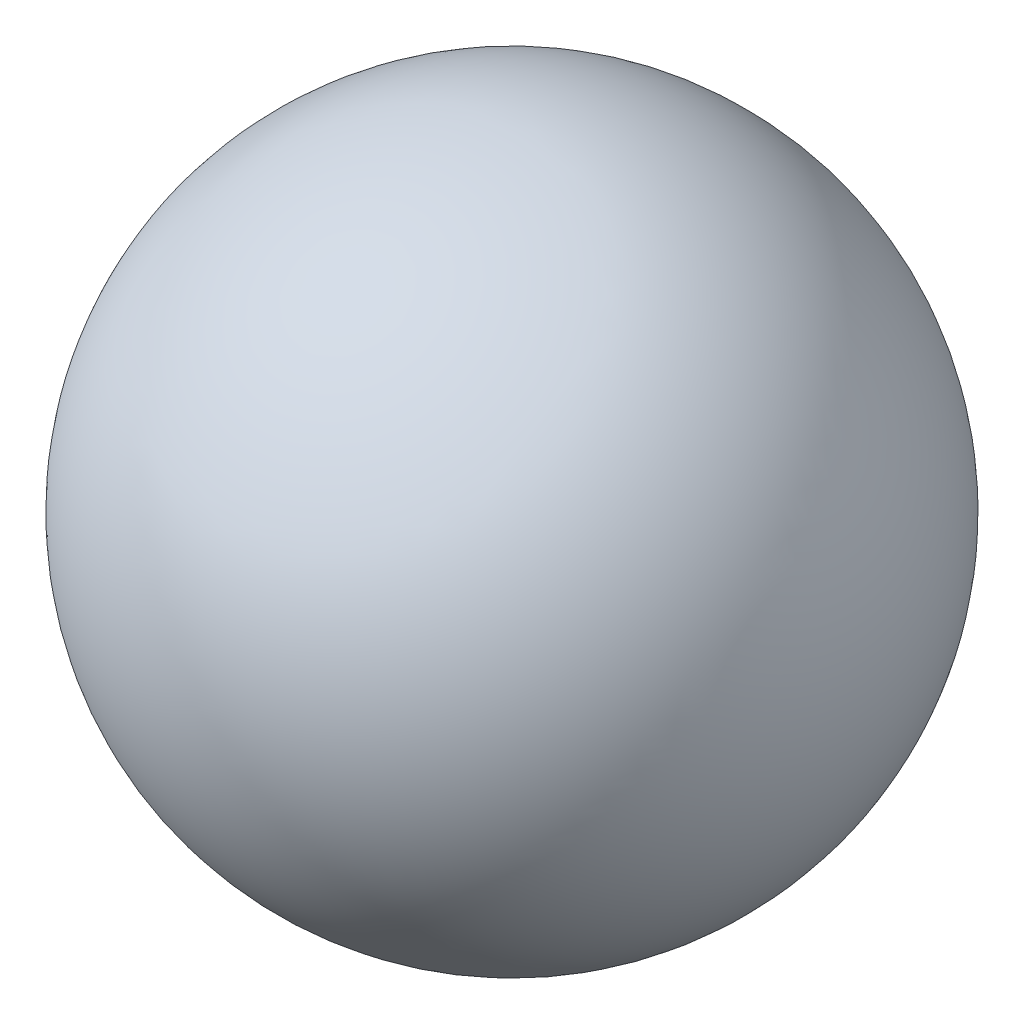
ISO-10303-21;
HEADER;
FILE_DESCRIPTION(('STEP AP214'),'2;1');
FILE_NAME('part.step','',(''),(''),'','','');
FILE_SCHEMA(('AUTOMOTIVE_DESIGN { 1 0 10303 214 1 1 1 1 }'));
ENDSEC;
DATA;
#1=APPLICATION_CONTEXT('core data for automotive mechanical design processes');
#2=APPLICATION_PROTOCOL_DEFINITION('international standard','automotive_design',2000,#1);
#3=PRODUCT_CONTEXT('',#1,'mechanical');
#4=PRODUCT('Part','Part','',(#3));
#5=PRODUCT_RELATED_PRODUCT_CATEGORY('part','',(#4));
#6=PRODUCT_DEFINITION_FORMATION('','',#4);
#7=PRODUCT_DEFINITION_CONTEXT('part definition',#1,'design');
#8=PRODUCT_DEFINITION('design','',#6,#7);
#9=PRODUCT_DEFINITION_SHAPE('','',#8);
#10=(LENGTH_UNIT() NAMED_UNIT(*) SI_UNIT(.MILLI.,.METRE.));
#11=(NAMED_UNIT(*) PLANE_ANGLE_UNIT() SI_UNIT($,.RADIAN.));
#12=(NAMED_UNIT(*) SI_UNIT($,.STERADIAN.) SOLID_ANGLE_UNIT());
#13=UNCERTAINTY_MEASURE_WITH_UNIT(LENGTH_MEASURE(1.E-05),#10,'distance_accuracy_value','');
#14=(GEOMETRIC_REPRESENTATION_CONTEXT(3) GLOBAL_UNCERTAINTY_ASSIGNED_CONTEXT((#13)) GLOBAL_UNIT_ASSIGNED_CONTEXT((#10,
#11,#12)) REPRESENTATION_CONTEXT('',''));
#15=CARTESIAN_POINT('',(0.,0.,0.));
#16=DIRECTION('',(0.,0.,1.));
#17=DIRECTION('',(1.,0.,0.));
#18=AXIS2_PLACEMENT_3D('',#15,#16,#17);
#19=CARTESIAN_POINT('',(0.,0.,0.));
#20=DIRECTION('',(-1.,0.,0.));
#21=DIRECTION('',(0.,1.,0.));
#22=AXIS2_PLACEMENT_3D('',#19,#20,#21);
#23=SPHERICAL_SURFACE('',#22,6.35);
#24=CARTESIAN_POINT('',(-6.35,0.,0.));
#25=VERTEX_POINT('',#24);
#26=VERTEX_LOOP('',#25);
#27=FACE_BOUND('',#26,.T.);
#28=ADVANCED_FACE('F33',(#27),#23,.T.);
#29=CLOSED_SHELL('',(#28));
#30=MANIFOLD_SOLID_BREP('B2',#29);
#31=ADVANCED_BREP_SHAPE_REPRESENTATION('',(#18,#30),#14);
#32=SHAPE_DEFINITION_REPRESENTATION(#9,#31);
ENDSEC;
END-ISO-10303-21;
